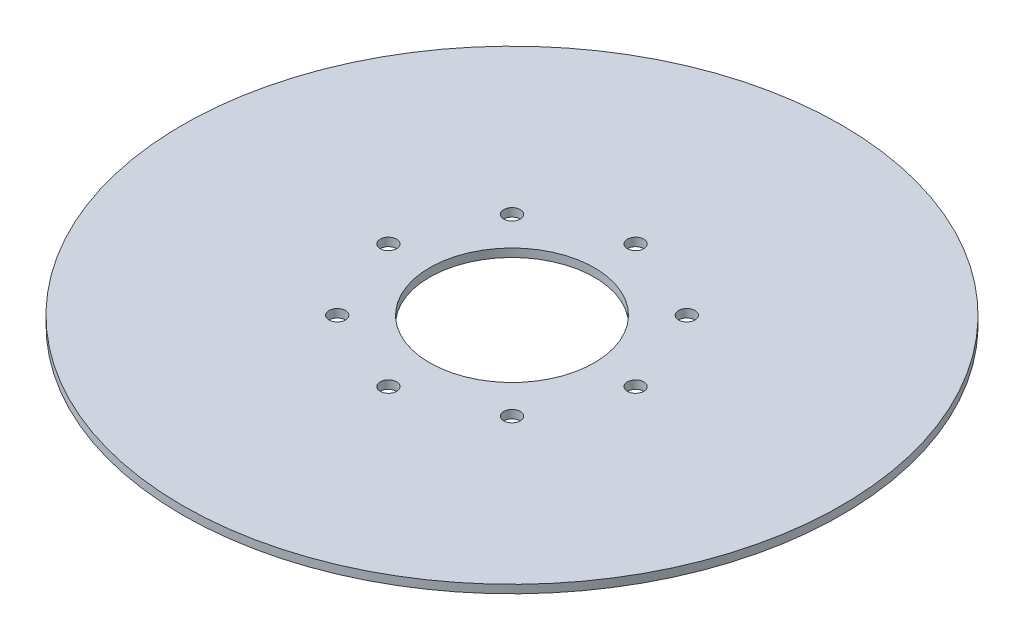
ISO-10303-21;
HEADER;
FILE_DESCRIPTION(('STEP AP214'),'2;1');
FILE_NAME('part.step','',(''),(''),'','','');
FILE_SCHEMA(('AUTOMOTIVE_DESIGN { 1 0 10303 214 1 1 1 1 }'));
ENDSEC;
DATA;
#1=APPLICATION_CONTEXT('core data for automotive mechanical design processes');
#2=APPLICATION_PROTOCOL_DEFINITION('international standard','automotive_design',2000,#1);
#3=PRODUCT_CONTEXT('',#1,'mechanical');
#4=PRODUCT('Part','Part','',(#3));
#5=PRODUCT_RELATED_PRODUCT_CATEGORY('part','',(#4));
#6=PRODUCT_DEFINITION_FORMATION('','',#4);
#7=PRODUCT_DEFINITION_CONTEXT('part definition',#1,'design');
#8=PRODUCT_DEFINITION('design','',#6,#7);
#9=PRODUCT_DEFINITION_SHAPE('','',#8);
#10=(LENGTH_UNIT() NAMED_UNIT(*) SI_UNIT(.MILLI.,.METRE.));
#11=(NAMED_UNIT(*) PLANE_ANGLE_UNIT() SI_UNIT($,.RADIAN.));
#12=(NAMED_UNIT(*) SI_UNIT($,.STERADIAN.) SOLID_ANGLE_UNIT());
#13=UNCERTAINTY_MEASURE_WITH_UNIT(LENGTH_MEASURE(1.E-05),#10,'distance_accuracy_value','');
#14=(GEOMETRIC_REPRESENTATION_CONTEXT(3) GLOBAL_UNCERTAINTY_ASSIGNED_CONTEXT((#13)) GLOBAL_UNIT_ASSIGNED_CONTEXT((#10,
#11,#12)) REPRESENTATION_CONTEXT('',''));
#15=CARTESIAN_POINT('',(0.,0.,0.));
#16=DIRECTION('',(0.,0.,1.));
#17=DIRECTION('',(1.,0.,0.));
#18=AXIS2_PLACEMENT_3D('',#15,#16,#17);
#19=CARTESIAN_POINT('',(0.,1.,0.));
#20=DIRECTION('',(0.,-1.,0.));
#21=DIRECTION('',(0.,0.,-1.));
#22=AXIS2_PLACEMENT_3D('',#19,#20,#21);
#23=CYLINDRICAL_SURFACE('',#22,40.);
#24=CARTESIAN_POINT('',(0.,1.,0.));
#25=DIRECTION('',(0.,1.,0.));
#26=DIRECTION('',(0.,0.,1.));
#27=AXIS2_PLACEMENT_3D('',#24,#25,#26);
#28=CIRCLE('',#27,40.);
#29=CARTESIAN_POINT('',(0.,1.,40.));
#30=VERTEX_POINT('',#29);
#31=EDGE_CURVE('E10',#30,#30,#28,.T.);
#32=ORIENTED_EDGE('',*,*,#31,.F.);
#33=EDGE_LOOP('',(#32));
#34=FACE_BOUND('',#33,.T.);
#35=CARTESIAN_POINT('',(0.,0.,0.));
#36=DIRECTION('',(0.,1.,0.));
#37=DIRECTION('',(0.,0.,1.));
#38=AXIS2_PLACEMENT_3D('',#35,#36,#37);
#39=CIRCLE('',#38,40.);
#40=CARTESIAN_POINT('',(0.,0.,40.));
#41=VERTEX_POINT('',#40);
#42=EDGE_CURVE('E43',#41,#41,#39,.T.);
#43=ORIENTED_EDGE('',*,*,#42,.T.);
#44=EDGE_LOOP('',(#43));
#45=FACE_BOUND('',#44,.T.);
#46=ADVANCED_FACE('F40',(#34,#45),#23,.T.);
#47=CARTESIAN_POINT('',(0.,1.,0.));
#48=DIRECTION('',(0.,1.,0.));
#49=DIRECTION('',(0.,0.,1.));
#50=AXIS2_PLACEMENT_3D('',#47,#48,#49);
#51=PLANE('',#50);
#52=CARTESIAN_POINT('',(0.,1.,-15.));
#53=DIRECTION('',(0.,1.,0.));
#54=DIRECTION('',(0.,0.,1.));
#55=AXIS2_PLACEMENT_3D('',#52,#53,#54);
#56=CIRCLE('',#55,1.00000000000097);
#57=CARTESIAN_POINT('',(0.,1.,-13.999999999999));
#58=VERTEX_POINT('',#57);
#59=EDGE_CURVE('E118',#58,#58,#56,.T.);
#60=ORIENTED_EDGE('',*,*,#59,.F.);
#61=EDGE_LOOP('',(#60));
#62=FACE_BOUND('',#61,.T.);
#63=CARTESIAN_POINT('',(10.6066017177984,1.,-10.6066017177987));
#64=DIRECTION('',(0.,1.,0.));
#65=DIRECTION('',(0.,0.,1.));
#66=AXIS2_PLACEMENT_3D('',#63,#64,#65);
#67=CIRCLE('',#66,1.00000000000097);
#68=CARTESIAN_POINT('',(10.6066017177984,1.,-9.60660171779769));
#69=VERTEX_POINT('',#68);
#70=EDGE_CURVE('E111',#69,#69,#67,.T.);
#71=ORIENTED_EDGE('',*,*,#70,.F.);
#72=EDGE_LOOP('',(#71));
#73=FACE_BOUND('',#72,.T.);
#74=CARTESIAN_POINT('',(15.0000000000007,1.,-6.37651491985369E-13));
#75=DIRECTION('',(0.,1.,0.));
#76=DIRECTION('',(0.,0.,1.));
#77=AXIS2_PLACEMENT_3D('',#74,#75,#76);
#78=CIRCLE('',#77,1.00000000000098);
#79=CARTESIAN_POINT('',(15.0000000000007,1.,1.00000000000034));
#80=VERTEX_POINT('',#79);
#81=EDGE_CURVE('E103',#80,#80,#78,.T.);
#82=ORIENTED_EDGE('',*,*,#81,.F.);
#83=EDGE_LOOP('',(#82));
#84=FACE_BOUND('',#83,.T.);
#85=CARTESIAN_POINT('',(10.6066017177993,1.,10.6066017177978));
#86=DIRECTION('',(0.,1.,0.));
#87=DIRECTION('',(0.,0.,1.));
#88=AXIS2_PLACEMENT_3D('',#85,#86,#87);
#89=CIRCLE('',#88,1.00000000000101);
#90=CARTESIAN_POINT('',(10.6066017177993,1.,11.6066017177988));
#91=VERTEX_POINT('',#90);
#92=EDGE_CURVE('E95',#91,#91,#89,.T.);
#93=ORIENTED_EDGE('',*,*,#92,.F.);
#94=EDGE_LOOP('',(#93));
#95=FACE_BOUND('',#94,.T.);
#96=CARTESIAN_POINT('',(1.29289571011559E-12,1.,15.));
#97=DIRECTION('',(0.,1.,0.));
#98=DIRECTION('',(0.,0.,1.));
#99=AXIS2_PLACEMENT_3D('',#96,#97,#98);
#100=CIRCLE('',#99,1.00000000000097);
#101=CARTESIAN_POINT('',(1.29289571011559E-12,1.,16.000000000001));
#102=VERTEX_POINT('',#101);
#103=EDGE_CURVE('E87',#102,#102,#100,.T.);
#104=ORIENTED_EDGE('',*,*,#103,.F.);
#105=EDGE_LOOP('',(#104));
#106=FACE_BOUND('',#105,.T.);
#107=CARTESIAN_POINT('',(-10.6066017177971,1.,10.6066017177987));
#108=DIRECTION('',(0.,1.,0.));
#109=DIRECTION('',(0.,0.,1.));
#110=AXIS2_PLACEMENT_3D('',#107,#108,#109);
#111=CIRCLE('',#110,1.00000000000097);
#112=CARTESIAN_POINT('',(-10.6066017177971,1.,11.6066017177996));
#113=VERTEX_POINT('',#112);
#114=EDGE_CURVE('E79',#113,#113,#111,.T.);
#115=ORIENTED_EDGE('',*,*,#114,.F.);
#116=EDGE_LOOP('',(#115));
#117=FACE_BOUND('',#116,.T.);
#118=CARTESIAN_POINT('',(-14.9999999999993,1.,6.3948846218409E-13));
#119=DIRECTION('',(0.,1.,0.));
#120=DIRECTION('',(0.,0.,1.));
#121=AXIS2_PLACEMENT_3D('',#118,#119,#120);
#122=CIRCLE('',#121,1.00000000000097);
#123=CARTESIAN_POINT('',(-14.9999999999993,1.,1.00000000000161));
#124=VERTEX_POINT('',#123);
#125=EDGE_CURVE('E71',#124,#124,#122,.T.);
#126=ORIENTED_EDGE('',*,*,#125,.F.);
#127=EDGE_LOOP('',(#126));
#128=FACE_BOUND('',#127,.T.);
#129=CARTESIAN_POINT('',(-10.606601717798,1.,-10.6066017177978));
#130=DIRECTION('',(0.,1.,0.));
#131=DIRECTION('',(0.,0.,1.));
#132=AXIS2_PLACEMENT_3D('',#129,#130,#131);
#133=CIRCLE('',#132,1.00000000000097);
#134=CARTESIAN_POINT('',(-10.606601717798,1.,-9.60660171779679));
#135=VERTEX_POINT('',#134);
#136=EDGE_CURVE('E63',#135,#135,#133,.T.);
#137=ORIENTED_EDGE('',*,*,#136,.F.);
#138=EDGE_LOOP('',(#137));
#139=FACE_BOUND('',#138,.T.);
#140=CARTESIAN_POINT('',(0.,1.,0.));
#141=DIRECTION('',(0.,1.,0.));
#142=DIRECTION('',(0.,0.,1.));
#143=AXIS2_PLACEMENT_3D('',#140,#141,#142);
#144=CIRCLE('',#143,10.);
#145=CARTESIAN_POINT('',(0.,1.,10.));
#146=VERTEX_POINT('',#145);
#147=EDGE_CURVE('E55',#146,#146,#144,.T.);
#148=ORIENTED_EDGE('',*,*,#147,.F.);
#149=EDGE_LOOP('',(#148));
#150=FACE_BOUND('',#149,.T.);
#151=ORIENTED_EDGE('',*,*,#31,.T.);
#152=EDGE_LOOP('',(#151));
#153=FACE_BOUND('',#152,.T.);
#154=ADVANCED_FACE('F136',(#62,#73,#84,#95,#106,#117,#128,#139,#150,#153),#51,.T.);
#155=CARTESIAN_POINT('',(0.,0.,0.));
#156=DIRECTION('',(0.,1.,0.));
#157=DIRECTION('',(0.,0.,1.));
#158=AXIS2_PLACEMENT_3D('',#155,#156,#157);
#159=PLANE('',#158);
#160=CARTESIAN_POINT('',(0.,0.,-15.));
#161=DIRECTION('',(0.,1.,0.));
#162=DIRECTION('',(0.,0.,1.));
#163=AXIS2_PLACEMENT_3D('',#160,#161,#162);
#164=CIRCLE('',#163,1.00000000000097);
#165=CARTESIAN_POINT('',(0.,0.,-13.999999999999));
#166=VERTEX_POINT('',#165);
#167=EDGE_CURVE('E59',#166,#166,#164,.T.);
#168=ORIENTED_EDGE('',*,*,#167,.T.);
#169=EDGE_LOOP('',(#168));
#170=FACE_BOUND('',#169,.T.);
#171=CARTESIAN_POINT('',(10.6066017177984,0.,-10.6066017177987));
#172=DIRECTION('',(0.,1.,0.));
#173=DIRECTION('',(0.,0.,1.));
#174=AXIS2_PLACEMENT_3D('',#171,#172,#173);
#175=CIRCLE('',#174,1.00000000000097);
#176=CARTESIAN_POINT('',(10.6066017177984,0.,-9.60660171779769));
#177=VERTEX_POINT('',#176);
#178=EDGE_CURVE('E115',#177,#177,#175,.T.);
#179=ORIENTED_EDGE('',*,*,#178,.T.);
#180=EDGE_LOOP('',(#179));
#181=FACE_BOUND('',#180,.T.);
#182=CARTESIAN_POINT('',(15.0000000000007,0.,-6.37651491985369E-13));
#183=DIRECTION('',(0.,1.,0.));
#184=DIRECTION('',(0.,0.,1.));
#185=AXIS2_PLACEMENT_3D('',#182,#183,#184);
#186=CIRCLE('',#185,1.00000000000098);
#187=CARTESIAN_POINT('',(15.0000000000007,0.,1.00000000000034));
#188=VERTEX_POINT('',#187);
#189=EDGE_CURVE('E107',#188,#188,#186,.T.);
#190=ORIENTED_EDGE('',*,*,#189,.T.);
#191=EDGE_LOOP('',(#190));
#192=FACE_BOUND('',#191,.T.);
#193=CARTESIAN_POINT('',(10.6066017177993,0.,10.6066017177978));
#194=DIRECTION('',(0.,1.,0.));
#195=DIRECTION('',(0.,0.,1.));
#196=AXIS2_PLACEMENT_3D('',#193,#194,#195);
#197=CIRCLE('',#196,1.00000000000101);
#198=CARTESIAN_POINT('',(10.6066017177993,0.,11.6066017177988));
#199=VERTEX_POINT('',#198);
#200=EDGE_CURVE('E99',#199,#199,#197,.T.);
#201=ORIENTED_EDGE('',*,*,#200,.T.);
#202=EDGE_LOOP('',(#201));
#203=FACE_BOUND('',#202,.T.);
#204=CARTESIAN_POINT('',(1.29289571011559E-12,0.,15.));
#205=DIRECTION('',(0.,1.,0.));
#206=DIRECTION('',(0.,0.,1.));
#207=AXIS2_PLACEMENT_3D('',#204,#205,#206);
#208=CIRCLE('',#207,1.00000000000097);
#209=CARTESIAN_POINT('',(1.29289571011559E-12,0.,16.000000000001));
#210=VERTEX_POINT('',#209);
#211=EDGE_CURVE('E91',#210,#210,#208,.T.);
#212=ORIENTED_EDGE('',*,*,#211,.T.);
#213=EDGE_LOOP('',(#212));
#214=FACE_BOUND('',#213,.T.);
#215=CARTESIAN_POINT('',(-10.6066017177971,0.,10.6066017177987));
#216=DIRECTION('',(0.,1.,0.));
#217=DIRECTION('',(0.,0.,1.));
#218=AXIS2_PLACEMENT_3D('',#215,#216,#217);
#219=CIRCLE('',#218,1.00000000000097);
#220=CARTESIAN_POINT('',(-10.6066017177971,0.,11.6066017177996));
#221=VERTEX_POINT('',#220);
#222=EDGE_CURVE('E83',#221,#221,#219,.T.);
#223=ORIENTED_EDGE('',*,*,#222,.T.);
#224=EDGE_LOOP('',(#223));
#225=FACE_BOUND('',#224,.T.);
#226=CARTESIAN_POINT('',(-14.9999999999993,0.,6.3948846218409E-13));
#227=DIRECTION('',(0.,1.,0.));
#228=DIRECTION('',(0.,0.,1.));
#229=AXIS2_PLACEMENT_3D('',#226,#227,#228);
#230=CIRCLE('',#229,1.00000000000097);
#231=CARTESIAN_POINT('',(-14.9999999999993,0.,1.00000000000161));
#232=VERTEX_POINT('',#231);
#233=EDGE_CURVE('E75',#232,#232,#230,.T.);
#234=ORIENTED_EDGE('',*,*,#233,.T.);
#235=EDGE_LOOP('',(#234));
#236=FACE_BOUND('',#235,.T.);
#237=CARTESIAN_POINT('',(-10.606601717798,0.,-10.6066017177978));
#238=DIRECTION('',(0.,1.,0.));
#239=DIRECTION('',(0.,0.,1.));
#240=AXIS2_PLACEMENT_3D('',#237,#238,#239);
#241=CIRCLE('',#240,1.00000000000097);
#242=CARTESIAN_POINT('',(-10.606601717798,0.,-9.60660171779679));
#243=VERTEX_POINT('',#242);
#244=EDGE_CURVE('E67',#243,#243,#241,.T.);
#245=ORIENTED_EDGE('',*,*,#244,.T.);
#246=EDGE_LOOP('',(#245));
#247=FACE_BOUND('',#246,.T.);
#248=CARTESIAN_POINT('',(0.,0.,0.));
#249=DIRECTION('',(0.,1.,0.));
#250=DIRECTION('',(0.,0.,1.));
#251=AXIS2_PLACEMENT_3D('',#248,#249,#250);
#252=CIRCLE('',#251,10.);
#253=CARTESIAN_POINT('',(0.,0.,10.));
#254=VERTEX_POINT('',#253);
#255=EDGE_CURVE('E53',#254,#254,#252,.T.);
#256=ORIENTED_EDGE('',*,*,#255,.T.);
#257=EDGE_LOOP('',(#256));
#258=FACE_BOUND('',#257,.T.);
#259=ORIENTED_EDGE('',*,*,#42,.F.);
#260=EDGE_LOOP('',(#259));
#261=FACE_BOUND('',#260,.T.);
#262=ADVANCED_FACE('F126',(#170,#181,#192,#203,#214,#225,#236,#247,#258,#261),#159,.F.);
#263=CARTESIAN_POINT('',(0.,0.,0.));
#264=DIRECTION('',(0.,1.,0.));
#265=DIRECTION('',(0.,0.,1.));
#266=AXIS2_PLACEMENT_3D('',#263,#264,#265);
#267=CYLINDRICAL_SURFACE('',#266,10.);
#268=ORIENTED_EDGE('',*,*,#255,.F.);
#269=EDGE_LOOP('',(#268));
#270=FACE_BOUND('',#269,.T.);
#271=ORIENTED_EDGE('',*,*,#147,.T.);
#272=EDGE_LOOP('',(#271));
#273=FACE_BOUND('',#272,.T.);
#274=ADVANCED_FACE('F156',(#270,#273),#267,.F.);
#275=CARTESIAN_POINT('',(-10.606601717798,0.,-10.6066017177978));
#276=DIRECTION('',(0.,1.,0.));
#277=DIRECTION('',(0.,0.,1.));
#278=AXIS2_PLACEMENT_3D('',#275,#276,#277);
#279=CYLINDRICAL_SURFACE('',#278,1.00000000000097);
#280=ORIENTED_EDGE('',*,*,#244,.F.);
#281=EDGE_LOOP('',(#280));
#282=FACE_BOUND('',#281,.T.);
#283=ORIENTED_EDGE('',*,*,#136,.T.);
#284=EDGE_LOOP('',(#283));
#285=FACE_BOUND('',#284,.T.);
#286=ADVANCED_FACE('F158',(#282,#285),#279,.F.);
#287=CARTESIAN_POINT('',(-14.9999999999993,0.,6.3948846218409E-13));
#288=DIRECTION('',(0.,1.,0.));
#289=DIRECTION('',(0.,0.,1.));
#290=AXIS2_PLACEMENT_3D('',#287,#288,#289);
#291=CYLINDRICAL_SURFACE('',#290,1.00000000000097);
#292=ORIENTED_EDGE('',*,*,#233,.F.);
#293=EDGE_LOOP('',(#292));
#294=FACE_BOUND('',#293,.T.);
#295=ORIENTED_EDGE('',*,*,#125,.T.);
#296=EDGE_LOOP('',(#295));
#297=FACE_BOUND('',#296,.T.);
#298=ADVANCED_FACE('F165',(#294,#297),#291,.F.);
#299=CARTESIAN_POINT('',(-10.6066017177971,0.,10.6066017177987));
#300=DIRECTION('',(0.,1.,0.));
#301=DIRECTION('',(0.,0.,1.));
#302=AXIS2_PLACEMENT_3D('',#299,#300,#301);
#303=CYLINDRICAL_SURFACE('',#302,1.00000000000097);
#304=ORIENTED_EDGE('',*,*,#222,.F.);
#305=EDGE_LOOP('',(#304));
#306=FACE_BOUND('',#305,.T.);
#307=ORIENTED_EDGE('',*,*,#114,.T.);
#308=EDGE_LOOP('',(#307));
#309=FACE_BOUND('',#308,.T.);
#310=ADVANCED_FACE('F204',(#306,#309),#303,.F.);
#311=CARTESIAN_POINT('',(1.29289571011559E-12,0.,15.));
#312=DIRECTION('',(0.,1.,0.));
#313=DIRECTION('',(0.,0.,1.));
#314=AXIS2_PLACEMENT_3D('',#311,#312,#313);
#315=CYLINDRICAL_SURFACE('',#314,1.00000000000097);
#316=ORIENTED_EDGE('',*,*,#211,.F.);
#317=EDGE_LOOP('',(#316));
#318=FACE_BOUND('',#317,.T.);
#319=ORIENTED_EDGE('',*,*,#103,.T.);
#320=EDGE_LOOP('',(#319));
#321=FACE_BOUND('',#320,.T.);
#322=ADVANCED_FACE('F214',(#318,#321),#315,.F.);
#323=CARTESIAN_POINT('',(10.6066017177993,0.,10.6066017177978));
#324=DIRECTION('',(0.,1.,0.));
#325=DIRECTION('',(0.,0.,1.));
#326=AXIS2_PLACEMENT_3D('',#323,#324,#325);
#327=CYLINDRICAL_SURFACE('',#326,1.00000000000101);
#328=ORIENTED_EDGE('',*,*,#200,.F.);
#329=EDGE_LOOP('',(#328));
#330=FACE_BOUND('',#329,.T.);
#331=ORIENTED_EDGE('',*,*,#92,.T.);
#332=EDGE_LOOP('',(#331));
#333=FACE_BOUND('',#332,.T.);
#334=ADVANCED_FACE('F224',(#330,#333),#327,.F.);
#335=CARTESIAN_POINT('',(15.0000000000007,0.,-6.37651491985369E-13));
#336=DIRECTION('',(0.,1.,0.));
#337=DIRECTION('',(0.,0.,1.));
#338=AXIS2_PLACEMENT_3D('',#335,#336,#337);
#339=CYLINDRICAL_SURFACE('',#338,1.00000000000098);
#340=ORIENTED_EDGE('',*,*,#189,.F.);
#341=EDGE_LOOP('',(#340));
#342=FACE_BOUND('',#341,.T.);
#343=ORIENTED_EDGE('',*,*,#81,.T.);
#344=EDGE_LOOP('',(#343));
#345=FACE_BOUND('',#344,.T.);
#346=ADVANCED_FACE('F234',(#342,#345),#339,.F.);
#347=CARTESIAN_POINT('',(10.6066017177984,0.,-10.6066017177987));
#348=DIRECTION('',(0.,1.,0.));
#349=DIRECTION('',(0.,0.,1.));
#350=AXIS2_PLACEMENT_3D('',#347,#348,#349);
#351=CYLINDRICAL_SURFACE('',#350,1.00000000000097);
#352=ORIENTED_EDGE('',*,*,#178,.F.);
#353=EDGE_LOOP('',(#352));
#354=FACE_BOUND('',#353,.T.);
#355=ORIENTED_EDGE('',*,*,#70,.T.);
#356=EDGE_LOOP('',(#355));
#357=FACE_BOUND('',#356,.T.);
#358=ADVANCED_FACE('F132',(#354,#357),#351,.F.);
#359=CARTESIAN_POINT('',(0.,0.,-15.));
#360=DIRECTION('',(0.,1.,0.));
#361=DIRECTION('',(0.,0.,1.));
#362=AXIS2_PLACEMENT_3D('',#359,#360,#361);
#363=CYLINDRICAL_SURFACE('',#362,1.00000000000097);
#364=ORIENTED_EDGE('',*,*,#167,.F.);
#365=EDGE_LOOP('',(#364));
#366=FACE_BOUND('',#365,.T.);
#367=ORIENTED_EDGE('',*,*,#59,.T.);
#368=EDGE_LOOP('',(#367));
#369=FACE_BOUND('',#368,.T.);
#370=ADVANCED_FACE('F129',(#366,#369),#363,.F.);
#371=CLOSED_SHELL('',(#46,#154,#262,#274,#286,#298,#310,#322,#334,#346,#358,#370));
#372=MANIFOLD_SOLID_BREP('B2',#371);
#373=ADVANCED_BREP_SHAPE_REPRESENTATION('',(#18,#372),#14);
#374=SHAPE_DEFINITION_REPRESENTATION(#9,#373);
ENDSEC;
END-ISO-10303-21;
